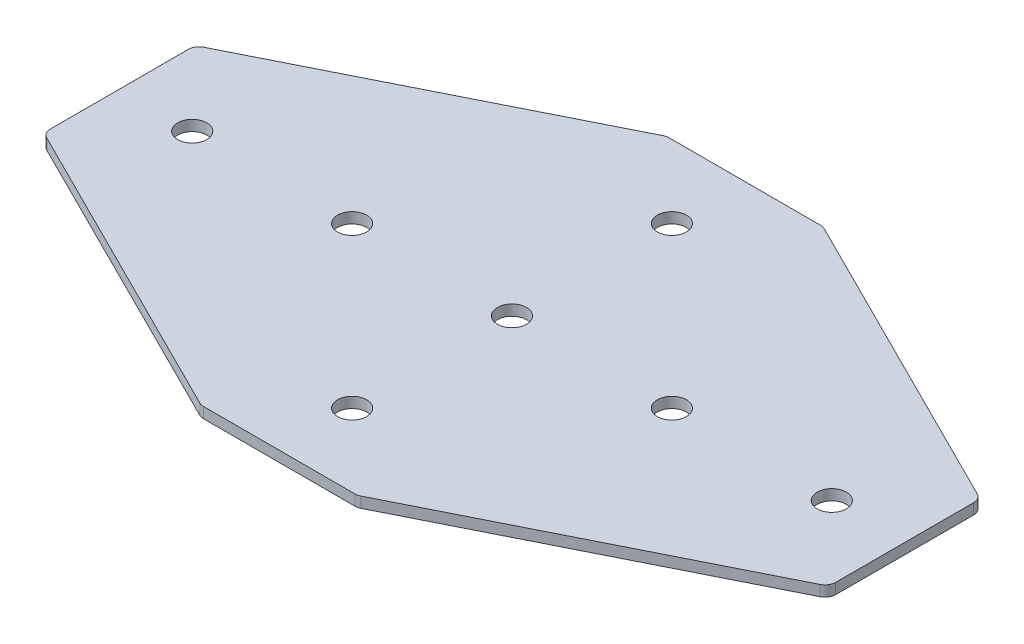
ISO-10303-21;
HEADER;
FILE_DESCRIPTION(('STEP AP214'),'2;1');
FILE_NAME('part.step','',(''),(''),'','','');
FILE_SCHEMA(('AUTOMOTIVE_DESIGN { 1 0 10303 214 1 1 1 1 }'));
ENDSEC;
DATA;
#1=APPLICATION_CONTEXT('core data for automotive mechanical design processes');
#2=APPLICATION_PROTOCOL_DEFINITION('international standard','automotive_design',2000,#1);
#3=PRODUCT_CONTEXT('',#1,'mechanical');
#4=PRODUCT('Part','Part','',(#3));
#5=PRODUCT_RELATED_PRODUCT_CATEGORY('part','',(#4));
#6=PRODUCT_DEFINITION_FORMATION('','',#4);
#7=PRODUCT_DEFINITION_CONTEXT('part definition',#1,'design');
#8=PRODUCT_DEFINITION('design','',#6,#7);
#9=PRODUCT_DEFINITION_SHAPE('','',#8);
#10=(LENGTH_UNIT() NAMED_UNIT(*) SI_UNIT(.MILLI.,.METRE.));
#11=(NAMED_UNIT(*) PLANE_ANGLE_UNIT() SI_UNIT($,.RADIAN.));
#12=(NAMED_UNIT(*) SI_UNIT($,.STERADIAN.) SOLID_ANGLE_UNIT());
#13=UNCERTAINTY_MEASURE_WITH_UNIT(LENGTH_MEASURE(1.E-05),#10,'distance_accuracy_value','');
#14=(GEOMETRIC_REPRESENTATION_CONTEXT(3) GLOBAL_UNCERTAINTY_ASSIGNED_CONTEXT((#13)) GLOBAL_UNIT_ASSIGNED_CONTEXT((#10,
#11,#12)) REPRESENTATION_CONTEXT('',''));
#15=CARTESIAN_POINT('',(0.,0.,0.));
#16=DIRECTION('',(0.,0.,1.));
#17=DIRECTION('',(1.,0.,0.));
#18=AXIS2_PLACEMENT_3D('',#15,#16,#17);
#19=CARTESIAN_POINT('',(-1.6121183435871,0.774709326741231,-0.662221309141842));
#20=DIRECTION('',(0.,-1.,0.));
#21=DIRECTION('',(0.,0.,-1.));
#22=AXIS2_PLACEMENT_3D('',#19,#20,#21);
#23=PLANE('',#22);
#24=CARTESIAN_POINT('',(-46.6121183435871,0.774709326741231,-0.66222130914182));
#25=DIRECTION('',(0.,-1.,0.));
#26=DIRECTION('',(0.,0.,1.));
#27=AXIS2_PLACEMENT_3D('',#24,#25,#26);
#28=CIRCLE('',#27,4.1);
#29=CARTESIAN_POINT('',(-46.6121183435871,0.774709326741231,3.43777869085818));
#30=VERTEX_POINT('',#29);
#31=EDGE_CURVE('E194',#30,#30,#28,.T.);
#32=ORIENTED_EDGE('',*,*,#31,.F.);
#33=EDGE_LOOP('',(#32));
#34=FACE_BOUND('',#33,.T.);
#35=CARTESIAN_POINT('',(-91.6121183435871,0.774709326741231,-0.66222130914182));
#36=DIRECTION('',(0.,-1.,0.));
#37=DIRECTION('',(0.,0.,1.));
#38=AXIS2_PLACEMENT_3D('',#35,#36,#37);
#39=CIRCLE('',#38,4.09999999999999);
#40=CARTESIAN_POINT('',(-91.6121183435871,0.774709326741231,3.43777869085817));
#41=VERTEX_POINT('',#40);
#42=EDGE_CURVE('E188',#41,#41,#39,.T.);
#43=ORIENTED_EDGE('',*,*,#42,.F.);
#44=EDGE_LOOP('',(#43));
#45=FACE_BOUND('',#44,.T.);
#46=CARTESIAN_POINT('',(-1.6121183435871,0.774709326741231,-0.662221309141842));
#47=DIRECTION('',(0.,1.,0.));
#48=DIRECTION('',(0.,0.,1.));
#49=AXIS2_PLACEMENT_3D('',#46,#47,#48);
#50=CIRCLE('',#49,4.1);
#51=CARTESIAN_POINT('',(-1.6121183435871,0.774709326741231,3.43777869085816));
#52=VERTEX_POINT('',#51);
#53=EDGE_CURVE('E248',#52,#52,#50,.T.);
#54=ORIENTED_EDGE('',*,*,#53,.T.);
#55=EDGE_LOOP('',(#54));
#56=FACE_BOUND('',#55,.T.);
#57=CARTESIAN_POINT('',(105.887881656413,0.774709326741231,-20.0720513653924));
#58=DIRECTION('',(0.,1.,0.));
#59=DIRECTION('',(0.,0.,1.));
#60=AXIS2_PLACEMENT_3D('',#57,#58,#59);
#61=CIRCLE('',#60,3.);
#62=CARTESIAN_POINT('',(108.887881656413,0.774709326741231,-20.0720513653924));
#63=VERTEX_POINT('',#62);
#64=CARTESIAN_POINT('',(107.229522442913,0.774709326741231,-22.7553329383922));
#65=VERTEX_POINT('',#64);
#66=EDGE_CURVE('E174',#63,#65,#61,.T.);
#67=ORIENTED_EDGE('',*,*,#66,.F.);
#68=DIRECTION('',(0.,0.,-1.));
#69=VECTOR('',#68,1.);
#70=CARTESIAN_POINT('',(108.887881656413,0.774709326741231,20.6017107133584));
#71=LINE('',#70,#69);
#72=CARTESIAN_POINT('',(108.887881656413,0.774709326741231,18.7476087471087));
#73=VERTEX_POINT('',#72);
#74=EDGE_CURVE('E259',#73,#63,#71,.T.);
#75=ORIENTED_EDGE('',*,*,#74,.F.);
#76=CARTESIAN_POINT('',(105.887881656413,0.774709326741231,18.7476087471087));
#77=DIRECTION('',(0.,-1.,0.));
#78=DIRECTION('',(0.,0.,-1.));
#79=AXIS2_PLACEMENT_3D('',#76,#77,#78);
#80=CIRCLE('',#79,3.);
#81=CARTESIAN_POINT('',(107.229522442913,0.774709326741231,21.4308903201085));
#82=VERTEX_POINT('',#81);
#83=EDGE_CURVE('E31',#73,#82,#80,.T.);
#84=ORIENTED_EDGE('',*,*,#83,.T.);
#85=DIRECTION('',(0.894427190999916,0.,-0.447213595499957));
#86=VECTOR('',#85,1.);
#87=CARTESIAN_POINT('',(20.4157457014133,0.774709326741231,64.8377786908581));
#88=LINE('',#87,#86);
#89=CARTESIAN_POINT('',(21.0491825554138,0.774709326741231,64.5210602638579));
#90=VERTEX_POINT('',#89);
#91=EDGE_CURVE('E256',#90,#82,#88,.T.);
#92=ORIENTED_EDGE('',*,*,#91,.F.);
#93=CARTESIAN_POINT('',(19.7075417689139,0.774709326741231,61.8377786908581));
#94=DIRECTION('',(0.,-1.,0.));
#95=DIRECTION('',(0.,0.,-1.));
#96=AXIS2_PLACEMENT_3D('',#93,#94,#95);
#97=CIRCLE('',#96,3.);
#98=CARTESIAN_POINT('',(19.707541768914,0.774709326741231,64.8377786908581));
#99=VERTEX_POINT('',#98);
#100=EDGE_CURVE('E274',#90,#99,#97,.T.);
#101=ORIENTED_EDGE('',*,*,#100,.T.);
#102=DIRECTION('',(1.,0.,0.));
#103=VECTOR('',#102,1.);
#104=CARTESIAN_POINT('',(-22.1121183435871,0.774709326741231,64.8377786908581));
#105=LINE('',#104,#103);
#106=CARTESIAN_POINT('',(-22.9317784560881,0.774709326741231,64.8377786908581));
#107=VERTEX_POINT('',#106);
#108=EDGE_CURVE('E254',#107,#99,#105,.T.);
#109=ORIENTED_EDGE('',*,*,#108,.F.);
#110=CARTESIAN_POINT('',(-22.9317784560881,0.774709326741231,61.8377786908581));
#111=DIRECTION('',(0.,1.,0.));
#112=DIRECTION('',(0.,0.,-1.));
#113=AXIS2_PLACEMENT_3D('',#110,#111,#112);
#114=CIRCLE('',#113,3.);
#115=CARTESIAN_POINT('',(-24.273419242588,0.774709326741231,64.5210602638579));
#116=VERTEX_POINT('',#115);
#117=EDGE_CURVE('E219',#116,#107,#114,.T.);
#118=ORIENTED_EDGE('',*,*,#117,.F.);
#119=DIRECTION('',(-0.894427190999916,0.,-0.447213595499957));
#120=VECTOR('',#119,1.);
#121=CARTESIAN_POINT('',(-23.6399823885875,0.774709326741231,64.8377786908581));
#122=LINE('',#121,#120);
#123=CARTESIAN_POINT('',(-110.453759130087,0.774709326741231,21.4308903201085));
#124=VERTEX_POINT('',#123);
#125=EDGE_CURVE('E200',#116,#124,#122,.T.);
#126=ORIENTED_EDGE('',*,*,#125,.T.);
#127=CARTESIAN_POINT('',(-109.112118343587,0.774709326741231,18.7476087471087));
#128=DIRECTION('',(0.,1.,0.));
#129=DIRECTION('',(0.,0.,-1.));
#130=AXIS2_PLACEMENT_3D('',#127,#128,#129);
#131=CIRCLE('',#130,3.);
#132=CARTESIAN_POINT('',(-112.112118343587,0.774709326741231,18.7476087471087));
#133=VERTEX_POINT('',#132);
#134=EDGE_CURVE('E216',#133,#124,#131,.T.);
#135=ORIENTED_EDGE('',*,*,#134,.F.);
#136=DIRECTION('',(0.,0.,-1.));
#137=VECTOR('',#136,1.);
#138=CARTESIAN_POINT('',(-112.112118343587,0.774709326741231,20.6017107133584));
#139=LINE('',#138,#137);
#140=CARTESIAN_POINT('',(-112.112118343587,0.774709326741231,-20.0720513653924));
#141=VERTEX_POINT('',#140);
#142=EDGE_CURVE('E203',#133,#141,#139,.T.);
#143=ORIENTED_EDGE('',*,*,#142,.T.);
#144=CARTESIAN_POINT('',(-109.112118343587,0.774709326741231,-20.0720513653924));
#145=DIRECTION('',(0.,-1.,0.));
#146=DIRECTION('',(0.,0.,1.));
#147=AXIS2_PLACEMENT_3D('',#144,#145,#146);
#148=CIRCLE('',#147,3.);
#149=CARTESIAN_POINT('',(-110.453759130087,0.774709326741231,-22.7553329383922));
#150=VERTEX_POINT('',#149);
#151=EDGE_CURVE('E140',#141,#150,#148,.T.);
#152=ORIENTED_EDGE('',*,*,#151,.T.);
#153=DIRECTION('',(-0.894427190999916,0.,0.447213595499957));
#154=VECTOR('',#153,1.);
#155=CARTESIAN_POINT('',(-23.6399823885875,0.774709326741231,-66.1622213091418));
#156=LINE('',#155,#154);
#157=CARTESIAN_POINT('',(-24.273419242588,0.774709326741231,-65.8455028821415));
#158=VERTEX_POINT('',#157);
#159=EDGE_CURVE('E414',#158,#150,#156,.T.);
#160=ORIENTED_EDGE('',*,*,#159,.F.);
#161=CARTESIAN_POINT('',(-22.9317784560881,0.774709326741231,-63.1622213091418));
#162=DIRECTION('',(0.,-1.,0.));
#163=DIRECTION('',(0.,0.,1.));
#164=AXIS2_PLACEMENT_3D('',#161,#162,#163);
#165=CIRCLE('',#164,3.);
#166=CARTESIAN_POINT('',(-22.9317784560881,0.774709326741231,-66.1622213091418));
#167=VERTEX_POINT('',#166);
#168=EDGE_CURVE('E399',#158,#167,#165,.T.);
#169=ORIENTED_EDGE('',*,*,#168,.T.);
#170=DIRECTION('',(1.,0.,0.));
#171=VECTOR('',#170,1.);
#172=CARTESIAN_POINT('',(-22.1121183435871,0.774709326741231,-66.1622213091418));
#173=LINE('',#172,#171);
#174=CARTESIAN_POINT('',(19.707541768914,0.774709326741231,-66.1622213091418));
#175=VERTEX_POINT('',#174);
#176=EDGE_CURVE('E136',#167,#175,#173,.T.);
#177=ORIENTED_EDGE('',*,*,#176,.T.);
#178=CARTESIAN_POINT('',(19.7075417689139,0.774709326741231,-63.1622213091418));
#179=DIRECTION('',(0.,1.,0.));
#180=DIRECTION('',(0.,0.,1.));
#181=AXIS2_PLACEMENT_3D('',#178,#179,#180);
#182=CIRCLE('',#181,3.);
#183=CARTESIAN_POINT('',(21.0491825554138,0.774709326741231,-65.8455028821415));
#184=VERTEX_POINT('',#183);
#185=EDGE_CURVE('E177',#184,#175,#182,.T.);
#186=ORIENTED_EDGE('',*,*,#185,.F.);
#187=DIRECTION('',(0.894427190999916,0.,0.447213595499957));
#188=VECTOR('',#187,1.);
#189=CARTESIAN_POINT('',(20.4157457014133,0.774709326741231,-66.1622213091418));
#190=LINE('',#189,#188);
#191=EDGE_CURVE('E165',#184,#65,#190,.T.);
#192=ORIENTED_EDGE('',*,*,#191,.T.);
#193=EDGE_LOOP('',(#67,#75,#84,#92,#101,#109,#118,#126,#135,#143,#152,#160,#169,#177,#186,#192));
#194=FACE_BOUND('',#193,.T.);
#195=CARTESIAN_POINT('',(88.3878816564129,0.774709326741231,-0.662221309141842));
#196=DIRECTION('',(0.,1.,0.));
#197=DIRECTION('',(0.,0.,1.));
#198=AXIS2_PLACEMENT_3D('',#195,#196,#197);
#199=CIRCLE('',#198,4.09999999999999);
#200=CARTESIAN_POINT('',(88.3878816564129,0.774709326741231,3.43777869085814));
#201=VERTEX_POINT('',#200);
#202=EDGE_CURVE('E230',#201,#201,#199,.T.);
#203=ORIENTED_EDGE('',*,*,#202,.T.);
#204=EDGE_LOOP('',(#203));
#205=FACE_BOUND('',#204,.T.);
#206=CARTESIAN_POINT('',(-1.61211834358711,0.774709326741231,44.3377786908582));
#207=DIRECTION('',(0.,1.,0.));
#208=DIRECTION('',(0.,0.,1.));
#209=AXIS2_PLACEMENT_3D('',#206,#207,#208);
#210=CIRCLE('',#209,4.1);
#211=CARTESIAN_POINT('',(-1.61211834358711,0.774709326741231,48.4377786908582));
#212=VERTEX_POINT('',#211);
#213=EDGE_CURVE('E236',#212,#212,#210,.T.);
#214=ORIENTED_EDGE('',*,*,#213,.T.);
#215=EDGE_LOOP('',(#214));
#216=FACE_BOUND('',#215,.T.);
#217=CARTESIAN_POINT('',(43.3878816564129,0.774709326741231,-0.662221309141831));
#218=DIRECTION('',(0.,1.,0.));
#219=DIRECTION('',(0.,0.,1.));
#220=AXIS2_PLACEMENT_3D('',#217,#218,#219);
#221=CIRCLE('',#220,4.1);
#222=CARTESIAN_POINT('',(43.3878816564129,0.774709326741231,3.43777869085817));
#223=VERTEX_POINT('',#222);
#224=EDGE_CURVE('E242',#223,#223,#221,.T.);
#225=ORIENTED_EDGE('',*,*,#224,.T.);
#226=EDGE_LOOP('',(#225));
#227=FACE_BOUND('',#226,.T.);
#228=CARTESIAN_POINT('',(-1.61211834358711,0.774709326741231,-45.6622213091418));
#229=DIRECTION('',(0.,-1.,0.));
#230=DIRECTION('',(0.,0.,-1.));
#231=AXIS2_PLACEMENT_3D('',#228,#229,#230);
#232=CIRCLE('',#231,4.1);
#233=CARTESIAN_POINT('',(-1.61211834358711,0.774709326741231,-49.7622213091418));
#234=VERTEX_POINT('',#233);
#235=EDGE_CURVE('E157',#234,#234,#232,.T.);
#236=ORIENTED_EDGE('',*,*,#235,.F.);
#237=EDGE_LOOP('',(#236));
#238=FACE_BOUND('',#237,.T.);
#239=ADVANCED_FACE('F16',(#34,#45,#56,#194,#205,#216,#227,#238),#23,.T.);
#240=CARTESIAN_POINT('',(108.887881656413,0.774709326741231,20.6017107133584));
#241=DIRECTION('',(1.,0.,0.));
#242=DIRECTION('',(0.,0.,-1.));
#243=AXIS2_PLACEMENT_3D('',#240,#241,#242);
#244=PLANE('',#243);
#245=ORIENTED_EDGE('',*,*,#74,.T.);
#246=DIRECTION('',(0.,1.,0.));
#247=VECTOR('',#246,1.);
#248=CARTESIAN_POINT('',(108.887881656413,0.774709326741231,-20.0720513653924));
#249=LINE('',#248,#247);
#250=CARTESIAN_POINT('',(108.887881656413,3.77470932674123,-20.0720513653924));
#251=VERTEX_POINT('',#250);
#252=EDGE_CURVE('E184',#251,#63,#249,.F.);
#253=ORIENTED_EDGE('',*,*,#252,.F.);
#254=DIRECTION('',(0.,0.,-1.));
#255=VECTOR('',#254,1.);
#256=CARTESIAN_POINT('',(108.887881656413,3.77470932674123,20.6017107133584));
#257=LINE('',#256,#255);
#258=CARTESIAN_POINT('',(108.887881656413,3.77470932674123,18.7476087471087));
#259=VERTEX_POINT('',#258);
#260=EDGE_CURVE('E257',#259,#251,#257,.T.);
#261=ORIENTED_EDGE('',*,*,#260,.F.);
#262=DIRECTION('',(0.,1.,0.));
#263=VECTOR('',#262,1.);
#264=CARTESIAN_POINT('',(108.887881656413,0.774709326741231,18.7476087471087));
#265=LINE('',#264,#263);
#266=EDGE_CURVE('E10',#259,#73,#265,.F.);
#267=ORIENTED_EDGE('',*,*,#266,.T.);
#268=EDGE_LOOP('',(#245,#253,#261,#267));
#269=FACE_BOUND('',#268,.T.);
#270=ADVANCED_FACE('F297',(#269),#244,.T.);
#271=CARTESIAN_POINT('',(-1.6121183435871,3.77470932674123,-0.662221309141842));
#272=DIRECTION('',(0.,-1.,0.));
#273=DIRECTION('',(0.,0.,-1.));
#274=AXIS2_PLACEMENT_3D('',#271,#272,#273);
#275=PLANE('',#274);
#276=CARTESIAN_POINT('',(-46.6121183435871,3.77470932674123,-0.66222130914182));
#277=DIRECTION('',(0.,-1.,0.));
#278=DIRECTION('',(0.,0.,1.));
#279=AXIS2_PLACEMENT_3D('',#276,#277,#278);
#280=CIRCLE('',#279,4.1);
#281=CARTESIAN_POINT('',(-46.6121183435871,3.77470932674123,3.43777869085818));
#282=VERTEX_POINT('',#281);
#283=EDGE_CURVE('E191',#282,#282,#280,.T.);
#284=ORIENTED_EDGE('',*,*,#283,.T.);
#285=EDGE_LOOP('',(#284));
#286=FACE_BOUND('',#285,.T.);
#287=CARTESIAN_POINT('',(-91.6121183435871,3.77470932674123,-0.66222130914182));
#288=DIRECTION('',(0.,-1.,0.));
#289=DIRECTION('',(0.,0.,1.));
#290=AXIS2_PLACEMENT_3D('',#287,#288,#289);
#291=CIRCLE('',#290,4.09999999999999);
#292=CARTESIAN_POINT('',(-91.6121183435871,3.77470932674123,3.43777869085817));
#293=VERTEX_POINT('',#292);
#294=EDGE_CURVE('E187',#293,#293,#291,.T.);
#295=ORIENTED_EDGE('',*,*,#294,.T.);
#296=EDGE_LOOP('',(#295));
#297=FACE_BOUND('',#296,.T.);
#298=CARTESIAN_POINT('',(-1.6121183435871,3.77470932674123,-0.662221309141842));
#299=DIRECTION('',(0.,1.,0.));
#300=DIRECTION('',(0.,0.,1.));
#301=AXIS2_PLACEMENT_3D('',#298,#299,#300);
#302=CIRCLE('',#301,4.1);
#303=CARTESIAN_POINT('',(-1.6121183435871,3.77470932674123,3.43777869085816));
#304=VERTEX_POINT('',#303);
#305=EDGE_CURVE('E245',#304,#304,#302,.T.);
#306=ORIENTED_EDGE('',*,*,#305,.F.);
#307=EDGE_LOOP('',(#306));
#308=FACE_BOUND('',#307,.T.);
#309=ORIENTED_EDGE('',*,*,#260,.T.);
#310=CARTESIAN_POINT('',(105.887881656413,3.77470932674123,-20.0720513653924));
#311=DIRECTION('',(0.,1.,0.));
#312=DIRECTION('',(0.,0.,1.));
#313=AXIS2_PLACEMENT_3D('',#310,#311,#312);
#314=CIRCLE('',#313,3.);
#315=CARTESIAN_POINT('',(107.229522442913,3.77470932674123,-22.7553329383922));
#316=VERTEX_POINT('',#315);
#317=EDGE_CURVE('E168',#316,#251,#314,.F.);
#318=ORIENTED_EDGE('',*,*,#317,.F.);
#319=DIRECTION('',(0.894427190999916,0.,0.447213595499957));
#320=VECTOR('',#319,1.);
#321=CARTESIAN_POINT('',(20.4157457014133,3.77470932674123,-66.1622213091418));
#322=LINE('',#321,#320);
#323=CARTESIAN_POINT('',(21.0491825554138,3.77470932674123,-65.8455028821415));
#324=VERTEX_POINT('',#323);
#325=EDGE_CURVE('E156',#324,#316,#322,.T.);
#326=ORIENTED_EDGE('',*,*,#325,.F.);
#327=CARTESIAN_POINT('',(19.7075417689139,3.77470932674123,-63.1622213091418));
#328=DIRECTION('',(0.,1.,0.));
#329=DIRECTION('',(0.,0.,1.));
#330=AXIS2_PLACEMENT_3D('',#327,#328,#329);
#331=CIRCLE('',#330,3.);
#332=CARTESIAN_POINT('',(19.707541768914,3.77470932674123,-66.1622213091418));
#333=VERTEX_POINT('',#332);
#334=EDGE_CURVE('E155',#333,#324,#331,.F.);
#335=ORIENTED_EDGE('',*,*,#334,.F.);
#336=DIRECTION('',(1.,0.,0.));
#337=VECTOR('',#336,1.);
#338=CARTESIAN_POINT('',(-22.1121183435871,3.77470932674123,-66.1622213091418));
#339=LINE('',#338,#337);
#340=CARTESIAN_POINT('',(-22.9317784560881,3.77470932674123,-66.1622213091418));
#341=VERTEX_POINT('',#340);
#342=EDGE_CURVE('E133',#341,#333,#339,.T.);
#343=ORIENTED_EDGE('',*,*,#342,.F.);
#344=CARTESIAN_POINT('',(-22.9317784560881,3.77470932674123,-63.1622213091418));
#345=DIRECTION('',(0.,-1.,0.));
#346=DIRECTION('',(0.,0.,1.));
#347=AXIS2_PLACEMENT_3D('',#344,#345,#346);
#348=CIRCLE('',#347,3.);
#349=CARTESIAN_POINT('',(-24.273419242588,3.77470932674123,-65.8455028821415));
#350=VERTEX_POINT('',#349);
#351=EDGE_CURVE('E141',#341,#350,#348,.F.);
#352=ORIENTED_EDGE('',*,*,#351,.T.);
#353=DIRECTION('',(-0.894427190999916,0.,0.447213595499957));
#354=VECTOR('',#353,1.);
#355=CARTESIAN_POINT('',(-23.6399823885875,3.77470932674123,-66.1622213091418));
#356=LINE('',#355,#354);
#357=CARTESIAN_POINT('',(-110.453759130087,3.77470932674123,-22.7553329383922));
#358=VERTEX_POINT('',#357);
#359=EDGE_CURVE('E415',#350,#358,#356,.T.);
#360=ORIENTED_EDGE('',*,*,#359,.T.);
#361=CARTESIAN_POINT('',(-109.112118343587,3.77470932674123,-20.0720513653924));
#362=DIRECTION('',(0.,-1.,0.));
#363=DIRECTION('',(0.,0.,1.));
#364=AXIS2_PLACEMENT_3D('',#361,#362,#363);
#365=CIRCLE('',#364,3.);
#366=CARTESIAN_POINT('',(-112.112118343587,3.77470932674123,-20.0720513653924));
#367=VERTEX_POINT('',#366);
#368=EDGE_CURVE('E149',#358,#367,#365,.F.);
#369=ORIENTED_EDGE('',*,*,#368,.T.);
#370=DIRECTION('',(0.,0.,-1.));
#371=VECTOR('',#370,1.);
#372=CARTESIAN_POINT('',(-112.112118343587,3.77470932674123,20.6017107133584));
#373=LINE('',#372,#371);
#374=CARTESIAN_POINT('',(-112.112118343587,3.77470932674123,18.7476087471087));
#375=VERTEX_POINT('',#374);
#376=EDGE_CURVE('E204',#375,#367,#373,.T.);
#377=ORIENTED_EDGE('',*,*,#376,.F.);
#378=CARTESIAN_POINT('',(-109.112118343587,3.77470932674123,18.7476087471087));
#379=DIRECTION('',(0.,1.,0.));
#380=DIRECTION('',(0.,0.,-1.));
#381=AXIS2_PLACEMENT_3D('',#378,#379,#380);
#382=CIRCLE('',#381,3.);
#383=CARTESIAN_POINT('',(-110.453759130087,3.77470932674123,21.4308903201085));
#384=VERTEX_POINT('',#383);
#385=EDGE_CURVE('E206',#384,#375,#382,.F.);
#386=ORIENTED_EDGE('',*,*,#385,.F.);
#387=DIRECTION('',(-0.894427190999916,0.,-0.447213595499957));
#388=VECTOR('',#387,1.);
#389=CARTESIAN_POINT('',(-23.6399823885875,3.77470932674123,64.8377786908581));
#390=LINE('',#389,#388);
#391=CARTESIAN_POINT('',(-24.273419242588,3.77470932674123,64.5210602638579));
#392=VERTEX_POINT('',#391);
#393=EDGE_CURVE('E197',#392,#384,#390,.T.);
#394=ORIENTED_EDGE('',*,*,#393,.F.);
#395=CARTESIAN_POINT('',(-22.9317784560881,3.77470932674123,61.8377786908581));
#396=DIRECTION('',(0.,1.,0.));
#397=DIRECTION('',(0.,0.,-1.));
#398=AXIS2_PLACEMENT_3D('',#395,#396,#397);
#399=CIRCLE('',#398,3.);
#400=CARTESIAN_POINT('',(-22.9317784560881,3.77470932674123,64.8377786908581));
#401=VERTEX_POINT('',#400);
#402=EDGE_CURVE('E211',#401,#392,#399,.F.);
#403=ORIENTED_EDGE('',*,*,#402,.F.);
#404=DIRECTION('',(1.,0.,0.));
#405=VECTOR('',#404,1.);
#406=CARTESIAN_POINT('',(-22.1121183435871,3.77470932674123,64.8377786908581));
#407=LINE('',#406,#405);
#408=CARTESIAN_POINT('',(19.707541768914,3.77470932674123,64.8377786908581));
#409=VERTEX_POINT('',#408);
#410=EDGE_CURVE('E251',#401,#409,#407,.T.);
#411=ORIENTED_EDGE('',*,*,#410,.T.);
#412=CARTESIAN_POINT('',(19.7075417689139,3.77470932674123,61.8377786908581));
#413=DIRECTION('',(0.,-1.,0.));
#414=DIRECTION('',(0.,0.,-1.));
#415=AXIS2_PLACEMENT_3D('',#412,#413,#414);
#416=CIRCLE('',#415,3.);
#417=CARTESIAN_POINT('',(21.0491825554138,3.77470932674123,64.5210602638579));
#418=VERTEX_POINT('',#417);
#419=EDGE_CURVE('E268',#409,#418,#416,.F.);
#420=ORIENTED_EDGE('',*,*,#419,.T.);
#421=DIRECTION('',(0.894427190999916,0.,-0.447213595499957));
#422=VECTOR('',#421,1.);
#423=CARTESIAN_POINT('',(20.4157457014133,3.77470932674123,64.8377786908581));
#424=LINE('',#423,#422);
#425=CARTESIAN_POINT('',(107.229522442913,3.77470932674123,21.4308903201085));
#426=VERTEX_POINT('',#425);
#427=EDGE_CURVE('E263',#418,#426,#424,.T.);
#428=ORIENTED_EDGE('',*,*,#427,.T.);
#429=CARTESIAN_POINT('',(105.887881656413,3.77470932674123,18.7476087471087));
#430=DIRECTION('',(0.,-1.,0.));
#431=DIRECTION('',(0.,0.,-1.));
#432=AXIS2_PLACEMENT_3D('',#429,#430,#431);
#433=CIRCLE('',#432,3.);
#434=EDGE_CURVE('E261',#426,#259,#433,.F.);
#435=ORIENTED_EDGE('',*,*,#434,.T.);
#436=EDGE_LOOP('',(#309,#318,#326,#335,#343,#352,#360,#369,#377,#386,#394,#403,#411,#420,#428,#435));
#437=FACE_BOUND('',#436,.T.);
#438=CARTESIAN_POINT('',(88.3878816564129,3.77470932674123,-0.662221309141842));
#439=DIRECTION('',(0.,1.,0.));
#440=DIRECTION('',(0.,0.,1.));
#441=AXIS2_PLACEMENT_3D('',#438,#439,#440);
#442=CIRCLE('',#441,4.09999999999999);
#443=CARTESIAN_POINT('',(88.3878816564129,3.77470932674123,3.43777869085814));
#444=VERTEX_POINT('',#443);
#445=EDGE_CURVE('E229',#444,#444,#442,.T.);
#446=ORIENTED_EDGE('',*,*,#445,.F.);
#447=EDGE_LOOP('',(#446));
#448=FACE_BOUND('',#447,.T.);
#449=CARTESIAN_POINT('',(-1.61211834358711,3.77470932674123,44.3377786908582));
#450=DIRECTION('',(0.,1.,0.));
#451=DIRECTION('',(0.,0.,1.));
#452=AXIS2_PLACEMENT_3D('',#449,#450,#451);
#453=CIRCLE('',#452,4.1);
#454=CARTESIAN_POINT('',(-1.61211834358711,3.77470932674123,48.4377786908582));
#455=VERTEX_POINT('',#454);
#456=EDGE_CURVE('E233',#455,#455,#453,.T.);
#457=ORIENTED_EDGE('',*,*,#456,.F.);
#458=EDGE_LOOP('',(#457));
#459=FACE_BOUND('',#458,.T.);
#460=CARTESIAN_POINT('',(43.3878816564129,3.77470932674123,-0.662221309141831));
#461=DIRECTION('',(0.,1.,0.));
#462=DIRECTION('',(0.,0.,1.));
#463=AXIS2_PLACEMENT_3D('',#460,#461,#462);
#464=CIRCLE('',#463,4.1);
#465=CARTESIAN_POINT('',(43.3878816564129,3.77470932674123,3.43777869085817));
#466=VERTEX_POINT('',#465);
#467=EDGE_CURVE('E239',#466,#466,#464,.T.);
#468=ORIENTED_EDGE('',*,*,#467,.F.);
#469=EDGE_LOOP('',(#468));
#470=FACE_BOUND('',#469,.T.);
#471=CARTESIAN_POINT('',(-1.61211834358711,3.77470932674123,-45.6622213091418));
#472=DIRECTION('',(0.,-1.,0.));
#473=DIRECTION('',(0.,0.,-1.));
#474=AXIS2_PLACEMENT_3D('',#471,#472,#473);
#475=CIRCLE('',#474,4.1);
#476=CARTESIAN_POINT('',(-1.61211834358711,3.77470932674123,-49.7622213091418));
#477=VERTEX_POINT('',#476);
#478=EDGE_CURVE('E162',#477,#477,#475,.T.);
#479=ORIENTED_EDGE('',*,*,#478,.T.);
#480=EDGE_LOOP('',(#479));
#481=FACE_BOUND('',#480,.T.);
#482=ADVANCED_FACE('F151',(#286,#297,#308,#437,#448,#459,#470,#481),#275,.F.);
#483=CARTESIAN_POINT('',(-1.6121183435871,0.774709326741231,-0.662221309141842));
#484=DIRECTION('',(0.,1.,0.));
#485=DIRECTION('',(0.,0.,1.));
#486=AXIS2_PLACEMENT_3D('',#483,#484,#485);
#487=CYLINDRICAL_SURFACE('',#486,4.1);
#488=ORIENTED_EDGE('',*,*,#53,.F.);
#489=EDGE_LOOP('',(#488));
#490=FACE_BOUND('',#489,.T.);
#491=ORIENTED_EDGE('',*,*,#305,.T.);
#492=EDGE_LOOP('',(#491));
#493=FACE_BOUND('',#492,.T.);
#494=ADVANCED_FACE('F373',(#490,#493),#487,.F.);
#495=CARTESIAN_POINT('',(43.3878816564129,0.774709326741231,-0.662221309141831));
#496=DIRECTION('',(0.,1.,0.));
#497=DIRECTION('',(0.,0.,1.));
#498=AXIS2_PLACEMENT_3D('',#495,#496,#497);
#499=CYLINDRICAL_SURFACE('',#498,4.1);
#500=ORIENTED_EDGE('',*,*,#467,.T.);
#501=EDGE_LOOP('',(#500));
#502=FACE_BOUND('',#501,.T.);
#503=ORIENTED_EDGE('',*,*,#224,.F.);
#504=EDGE_LOOP('',(#503));
#505=FACE_BOUND('',#504,.T.);
#506=ADVANCED_FACE('F366',(#502,#505),#499,.F.);
#507=CARTESIAN_POINT('',(88.3878816564129,0.774709326741231,-0.662221309141842));
#508=DIRECTION('',(0.,1.,0.));
#509=DIRECTION('',(0.,0.,1.));
#510=AXIS2_PLACEMENT_3D('',#507,#508,#509);
#511=CYLINDRICAL_SURFACE('',#510,4.09999999999999);
#512=ORIENTED_EDGE('',*,*,#445,.T.);
#513=EDGE_LOOP('',(#512));
#514=FACE_BOUND('',#513,.T.);
#515=ORIENTED_EDGE('',*,*,#202,.F.);
#516=EDGE_LOOP('',(#515));
#517=FACE_BOUND('',#516,.T.);
#518=ADVANCED_FACE('F350',(#514,#517),#511,.F.);
#519=CARTESIAN_POINT('',(-112.112118343587,0.774709326741231,20.6017107133584));
#520=DIRECTION('',(-1.,0.,0.));
#521=DIRECTION('',(0.,0.,-1.));
#522=AXIS2_PLACEMENT_3D('',#519,#520,#521);
#523=PLANE('',#522);
#524=ORIENTED_EDGE('',*,*,#376,.T.);
#525=DIRECTION('',(0.,1.,0.));
#526=VECTOR('',#525,1.);
#527=CARTESIAN_POINT('',(-112.112118343587,0.774709326741231,-20.0720513653924));
#528=LINE('',#527,#526);
#529=EDGE_CURVE('E402',#367,#141,#528,.F.);
#530=ORIENTED_EDGE('',*,*,#529,.T.);
#531=ORIENTED_EDGE('',*,*,#142,.F.);
#532=DIRECTION('',(0.,1.,0.));
#533=VECTOR('',#532,1.);
#534=CARTESIAN_POINT('',(-112.112118343587,0.774709326741231,18.7476087471087));
#535=LINE('',#534,#533);
#536=EDGE_CURVE('E227',#375,#133,#535,.F.);
#537=ORIENTED_EDGE('',*,*,#536,.F.);
#538=EDGE_LOOP('',(#524,#530,#531,#537));
#539=FACE_BOUND('',#538,.T.);
#540=ADVANCED_FACE('F346',(#539),#523,.T.);
#541=CARTESIAN_POINT('',(-46.6121183435871,0.774709326741231,-0.66222130914182));
#542=DIRECTION('',(0.,1.,0.));
#543=DIRECTION('',(0.,0.,1.));
#544=AXIS2_PLACEMENT_3D('',#541,#542,#543);
#545=CYLINDRICAL_SURFACE('',#544,4.1);
#546=ORIENTED_EDGE('',*,*,#31,.T.);
#547=EDGE_LOOP('',(#546));
#548=FACE_BOUND('',#547,.T.);
#549=ORIENTED_EDGE('',*,*,#283,.F.);
#550=EDGE_LOOP('',(#549));
#551=FACE_BOUND('',#550,.T.);
#552=ADVANCED_FACE('F342',(#548,#551),#545,.F.);
#553=CARTESIAN_POINT('',(-91.6121183435871,0.774709326741231,-0.66222130914182));
#554=DIRECTION('',(0.,1.,0.));
#555=DIRECTION('',(0.,0.,1.));
#556=AXIS2_PLACEMENT_3D('',#553,#554,#555);
#557=CYLINDRICAL_SURFACE('',#556,4.09999999999999);
#558=ORIENTED_EDGE('',*,*,#294,.F.);
#559=EDGE_LOOP('',(#558));
#560=FACE_BOUND('',#559,.T.);
#561=ORIENTED_EDGE('',*,*,#42,.T.);
#562=EDGE_LOOP('',(#561));
#563=FACE_BOUND('',#562,.T.);
#564=ADVANCED_FACE('F339',(#560,#563),#557,.F.);
#565=CARTESIAN_POINT('',(20.4157457014133,0.774709326741231,64.8377786908581));
#566=DIRECTION('',(0.447213595499957,0.,0.894427190999916));
#567=DIRECTION('',(0.894427190999916,0.,-0.447213595499957));
#568=AXIS2_PLACEMENT_3D('',#565,#566,#567);
#569=PLANE('',#568);
#570=ORIENTED_EDGE('',*,*,#427,.F.);
#571=DIRECTION('',(0.,1.,0.));
#572=VECTOR('',#571,1.);
#573=CARTESIAN_POINT('',(21.0491825554138,0.774709326741231,64.5210602638579));
#574=LINE('',#573,#572);
#575=EDGE_CURVE('E24',#418,#90,#574,.F.);
#576=ORIENTED_EDGE('',*,*,#575,.T.);
#577=ORIENTED_EDGE('',*,*,#91,.T.);
#578=DIRECTION('',(0.,1.,0.));
#579=VECTOR('',#578,1.);
#580=CARTESIAN_POINT('',(107.229522442913,0.774709326741231,21.4308903201085));
#581=LINE('',#580,#579);
#582=EDGE_CURVE('E277',#82,#426,#581,.T.);
#583=ORIENTED_EDGE('',*,*,#582,.T.);
#584=EDGE_LOOP('',(#570,#576,#577,#583));
#585=FACE_BOUND('',#584,.T.);
#586=ADVANCED_FACE('F280',(#585),#569,.T.);
#587=CARTESIAN_POINT('',(-22.1121183435871,0.774709326741231,64.8377786908581));
#588=DIRECTION('',(0.,0.,1.));
#589=DIRECTION('',(1.,0.,0.));
#590=AXIS2_PLACEMENT_3D('',#587,#588,#589);
#591=PLANE('',#590);
#592=ORIENTED_EDGE('',*,*,#410,.F.);
#593=DIRECTION('',(0.,1.,0.));
#594=VECTOR('',#593,1.);
#595=CARTESIAN_POINT('',(-22.9317784560881,0.774709326741231,64.8377786908581));
#596=LINE('',#595,#594);
#597=EDGE_CURVE('E213',#107,#401,#596,.T.);
#598=ORIENTED_EDGE('',*,*,#597,.F.);
#599=ORIENTED_EDGE('',*,*,#108,.T.);
#600=DIRECTION('',(0.,1.,0.));
#601=VECTOR('',#600,1.);
#602=CARTESIAN_POINT('',(19.707541768914,0.774709326741231,64.8377786908581));
#603=LINE('',#602,#601);
#604=EDGE_CURVE('E270',#99,#409,#603,.T.);
#605=ORIENTED_EDGE('',*,*,#604,.T.);
#606=EDGE_LOOP('',(#592,#598,#599,#605));
#607=FACE_BOUND('',#606,.T.);
#608=ADVANCED_FACE('F290',(#607),#591,.T.);
#609=CARTESIAN_POINT('',(19.7075417689139,0.774709326741231,61.8377786908581));
#610=DIRECTION('',(0.,1.,0.));
#611=DIRECTION('',(0.,0.,1.));
#612=AXIS2_PLACEMENT_3D('',#609,#610,#611);
#613=CYLINDRICAL_SURFACE('',#612,3.);
#614=ORIENTED_EDGE('',*,*,#100,.F.);
#615=ORIENTED_EDGE('',*,*,#575,.F.);
#616=ORIENTED_EDGE('',*,*,#419,.F.);
#617=ORIENTED_EDGE('',*,*,#604,.F.);
#618=EDGE_LOOP('',(#614,#615,#616,#617));
#619=FACE_BOUND('',#618,.T.);
#620=ADVANCED_FACE('F288',(#619),#613,.T.);
#621=CARTESIAN_POINT('',(105.887881656413,0.774709326741231,18.7476087471087));
#622=DIRECTION('',(0.,1.,0.));
#623=DIRECTION('',(0.,0.,1.));
#624=AXIS2_PLACEMENT_3D('',#621,#622,#623);
#625=CYLINDRICAL_SURFACE('',#624,3.);
#626=ORIENTED_EDGE('',*,*,#83,.F.);
#627=ORIENTED_EDGE('',*,*,#266,.F.);
#628=ORIENTED_EDGE('',*,*,#434,.F.);
#629=ORIENTED_EDGE('',*,*,#582,.F.);
#630=EDGE_LOOP('',(#626,#627,#628,#629));
#631=FACE_BOUND('',#630,.T.);
#632=ADVANCED_FACE('F18',(#631),#625,.T.);
#633=CARTESIAN_POINT('',(-1.61211834358711,0.774709326741231,44.3377786908582));
#634=DIRECTION('',(0.,1.,0.));
#635=DIRECTION('',(0.,0.,1.));
#636=AXIS2_PLACEMENT_3D('',#633,#634,#635);
#637=CYLINDRICAL_SURFACE('',#636,4.1);
#638=ORIENTED_EDGE('',*,*,#456,.T.);
#639=EDGE_LOOP('',(#638));
#640=FACE_BOUND('',#639,.T.);
#641=ORIENTED_EDGE('',*,*,#213,.F.);
#642=EDGE_LOOP('',(#641));
#643=FACE_BOUND('',#642,.T.);
#644=ADVANCED_FACE('F356',(#640,#643),#637,.F.);
#645=CARTESIAN_POINT('',(-23.6399823885875,0.774709326741231,64.8377786908581));
#646=DIRECTION('',(-0.447213595499957,0.,0.894427190999916));
#647=DIRECTION('',(-0.894427190999917,0.,-0.447213595499957));
#648=AXIS2_PLACEMENT_3D('',#645,#646,#647);
#649=PLANE('',#648);
#650=ORIENTED_EDGE('',*,*,#393,.T.);
#651=DIRECTION('',(0.,1.,0.));
#652=VECTOR('',#651,1.);
#653=CARTESIAN_POINT('',(-110.453759130087,0.774709326741231,21.4308903201085));
#654=LINE('',#653,#652);
#655=EDGE_CURVE('E222',#124,#384,#654,.T.);
#656=ORIENTED_EDGE('',*,*,#655,.F.);
#657=ORIENTED_EDGE('',*,*,#125,.F.);
#658=DIRECTION('',(0.,1.,0.));
#659=VECTOR('',#658,1.);
#660=CARTESIAN_POINT('',(-24.273419242588,0.774709326741231,64.5210602638579));
#661=LINE('',#660,#659);
#662=EDGE_CURVE('E225',#392,#116,#661,.F.);
#663=ORIENTED_EDGE('',*,*,#662,.F.);
#664=EDGE_LOOP('',(#650,#656,#657,#663));
#665=FACE_BOUND('',#664,.T.);
#666=ADVANCED_FACE('F352',(#665),#649,.T.);
#667=CARTESIAN_POINT('',(-22.9317784560881,0.774709326741231,61.8377786908581));
#668=DIRECTION('',(0.,1.,0.));
#669=DIRECTION('',(0.,0.,1.));
#670=AXIS2_PLACEMENT_3D('',#667,#668,#669);
#671=CYLINDRICAL_SURFACE('',#670,3.);
#672=ORIENTED_EDGE('',*,*,#117,.T.);
#673=ORIENTED_EDGE('',*,*,#597,.T.);
#674=ORIENTED_EDGE('',*,*,#402,.T.);
#675=ORIENTED_EDGE('',*,*,#662,.T.);
#676=EDGE_LOOP('',(#672,#673,#674,#675));
#677=FACE_BOUND('',#676,.T.);
#678=ADVANCED_FACE('F355',(#677),#671,.T.);
#679=CARTESIAN_POINT('',(-109.112118343587,0.774709326741231,18.7476087471087));
#680=DIRECTION('',(0.,1.,0.));
#681=DIRECTION('',(0.,0.,1.));
#682=AXIS2_PLACEMENT_3D('',#679,#680,#681);
#683=CYLINDRICAL_SURFACE('',#682,3.);
#684=ORIENTED_EDGE('',*,*,#134,.T.);
#685=ORIENTED_EDGE('',*,*,#655,.T.);
#686=ORIENTED_EDGE('',*,*,#385,.T.);
#687=ORIENTED_EDGE('',*,*,#536,.T.);
#688=EDGE_LOOP('',(#684,#685,#686,#687));
#689=FACE_BOUND('',#688,.T.);
#690=ADVANCED_FACE('F332',(#689),#683,.T.);
#691=CARTESIAN_POINT('',(20.4157457014133,0.774709326741231,-66.1622213091418));
#692=DIRECTION('',(0.447213595499957,0.,-0.894427190999916));
#693=DIRECTION('',(0.894427190999916,0.,0.447213595499957));
#694=AXIS2_PLACEMENT_3D('',#691,#692,#693);
#695=PLANE('',#694);
#696=ORIENTED_EDGE('',*,*,#325,.T.);
#697=DIRECTION('',(0.,1.,0.));
#698=VECTOR('',#697,1.);
#699=CARTESIAN_POINT('',(107.229522442913,0.774709326741231,-22.7553329383922));
#700=LINE('',#699,#698);
#701=EDGE_CURVE('E180',#65,#316,#700,.T.);
#702=ORIENTED_EDGE('',*,*,#701,.F.);
#703=ORIENTED_EDGE('',*,*,#191,.F.);
#704=DIRECTION('',(0.,1.,0.));
#705=VECTOR('',#704,1.);
#706=CARTESIAN_POINT('',(21.0491825554138,0.774709326741231,-65.8455028821415));
#707=LINE('',#706,#705);
#708=EDGE_CURVE('E182',#324,#184,#707,.F.);
#709=ORIENTED_EDGE('',*,*,#708,.F.);
#710=EDGE_LOOP('',(#696,#702,#703,#709));
#711=FACE_BOUND('',#710,.T.);
#712=ADVANCED_FACE('F329',(#711),#695,.T.);
#713=CARTESIAN_POINT('',(-22.1121183435871,0.774709326741231,-66.1622213091418));
#714=DIRECTION('',(0.,0.,-1.));
#715=DIRECTION('',(1.,0.,0.));
#716=AXIS2_PLACEMENT_3D('',#713,#714,#715);
#717=PLANE('',#716);
#718=ORIENTED_EDGE('',*,*,#342,.T.);
#719=DIRECTION('',(0.,1.,0.));
#720=VECTOR('',#719,1.);
#721=CARTESIAN_POINT('',(19.707541768914,0.774709326741231,-66.1622213091418));
#722=LINE('',#721,#720);
#723=EDGE_CURVE('E172',#175,#333,#722,.T.);
#724=ORIENTED_EDGE('',*,*,#723,.F.);
#725=ORIENTED_EDGE('',*,*,#176,.F.);
#726=DIRECTION('',(0.,1.,0.));
#727=VECTOR('',#726,1.);
#728=CARTESIAN_POINT('',(-22.9317784560881,0.774709326741231,-66.1622213091418));
#729=LINE('',#728,#727);
#730=EDGE_CURVE('E129',#167,#341,#729,.T.);
#731=ORIENTED_EDGE('',*,*,#730,.T.);
#732=EDGE_LOOP('',(#718,#724,#725,#731));
#733=FACE_BOUND('',#732,.T.);
#734=ADVANCED_FACE('F131',(#733),#717,.T.);
#735=CARTESIAN_POINT('',(19.7075417689139,0.774709326741231,-63.1622213091418));
#736=DIRECTION('',(0.,1.,0.));
#737=DIRECTION('',(0.,0.,-1.));
#738=AXIS2_PLACEMENT_3D('',#735,#736,#737);
#739=CYLINDRICAL_SURFACE('',#738,3.);
#740=ORIENTED_EDGE('',*,*,#185,.T.);
#741=ORIENTED_EDGE('',*,*,#723,.T.);
#742=ORIENTED_EDGE('',*,*,#334,.T.);
#743=ORIENTED_EDGE('',*,*,#708,.T.);
#744=EDGE_LOOP('',(#740,#741,#742,#743));
#745=FACE_BOUND('',#744,.T.);
#746=ADVANCED_FACE('F321',(#745),#739,.T.);
#747=CARTESIAN_POINT('',(105.887881656413,0.774709326741231,-20.0720513653924));
#748=DIRECTION('',(0.,1.,0.));
#749=DIRECTION('',(0.,0.,-1.));
#750=AXIS2_PLACEMENT_3D('',#747,#748,#749);
#751=CYLINDRICAL_SURFACE('',#750,3.);
#752=ORIENTED_EDGE('',*,*,#66,.T.);
#753=ORIENTED_EDGE('',*,*,#701,.T.);
#754=ORIENTED_EDGE('',*,*,#317,.T.);
#755=ORIENTED_EDGE('',*,*,#252,.T.);
#756=EDGE_LOOP('',(#752,#753,#754,#755));
#757=FACE_BOUND('',#756,.T.);
#758=ADVANCED_FACE('F311',(#757),#751,.T.);
#759=CARTESIAN_POINT('',(-1.61211834358711,0.774709326741231,-45.6622213091418));
#760=DIRECTION('',(0.,1.,0.));
#761=DIRECTION('',(0.,0.,-1.));
#762=AXIS2_PLACEMENT_3D('',#759,#760,#761);
#763=CYLINDRICAL_SURFACE('',#762,4.1);
#764=ORIENTED_EDGE('',*,*,#478,.F.);
#765=EDGE_LOOP('',(#764));
#766=FACE_BOUND('',#765,.T.);
#767=ORIENTED_EDGE('',*,*,#235,.T.);
#768=EDGE_LOOP('',(#767));
#769=FACE_BOUND('',#768,.T.);
#770=ADVANCED_FACE('F308',(#766,#769),#763,.F.);
#771=CARTESIAN_POINT('',(-23.6399823885875,0.774709326741231,-66.1622213091418));
#772=DIRECTION('',(-0.447213595499957,0.,-0.894427190999916));
#773=DIRECTION('',(-0.894427190999917,0.,0.447213595499957));
#774=AXIS2_PLACEMENT_3D('',#771,#772,#773);
#775=PLANE('',#774);
#776=ORIENTED_EDGE('',*,*,#359,.F.);
#777=DIRECTION('',(0.,1.,0.));
#778=VECTOR('',#777,1.);
#779=CARTESIAN_POINT('',(-24.273419242588,0.774709326741231,-65.8455028821415));
#780=LINE('',#779,#778);
#781=EDGE_CURVE('E145',#350,#158,#780,.F.);
#782=ORIENTED_EDGE('',*,*,#781,.T.);
#783=ORIENTED_EDGE('',*,*,#159,.T.);
#784=DIRECTION('',(0.,1.,0.));
#785=VECTOR('',#784,1.);
#786=CARTESIAN_POINT('',(-110.453759130087,0.774709326741231,-22.7553329383922));
#787=LINE('',#786,#785);
#788=EDGE_CURVE('E407',#150,#358,#787,.T.);
#789=ORIENTED_EDGE('',*,*,#788,.T.);
#790=EDGE_LOOP('',(#776,#782,#783,#789));
#791=FACE_BOUND('',#790,.T.);
#792=ADVANCED_FACE('F310',(#791),#775,.T.);
#793=CARTESIAN_POINT('',(-22.9317784560881,0.774709326741231,-63.1622213091418));
#794=DIRECTION('',(0.,1.,0.));
#795=DIRECTION('',(0.,0.,-1.));
#796=AXIS2_PLACEMENT_3D('',#793,#794,#795);
#797=CYLINDRICAL_SURFACE('',#796,3.);
#798=ORIENTED_EDGE('',*,*,#168,.F.);
#799=ORIENTED_EDGE('',*,*,#781,.F.);
#800=ORIENTED_EDGE('',*,*,#351,.F.);
#801=ORIENTED_EDGE('',*,*,#730,.F.);
#802=EDGE_LOOP('',(#798,#799,#800,#801));
#803=FACE_BOUND('',#802,.T.);
#804=ADVANCED_FACE('F144',(#803),#797,.T.);
#805=CARTESIAN_POINT('',(-109.112118343587,0.774709326741231,-20.0720513653924));
#806=DIRECTION('',(0.,1.,0.));
#807=DIRECTION('',(0.,0.,-1.));
#808=AXIS2_PLACEMENT_3D('',#805,#806,#807);
#809=CYLINDRICAL_SURFACE('',#808,3.);
#810=ORIENTED_EDGE('',*,*,#151,.F.);
#811=ORIENTED_EDGE('',*,*,#529,.F.);
#812=ORIENTED_EDGE('',*,*,#368,.F.);
#813=ORIENTED_EDGE('',*,*,#788,.F.);
#814=EDGE_LOOP('',(#810,#811,#812,#813));
#815=FACE_BOUND('',#814,.T.);
#816=ADVANCED_FACE('F327',(#815),#809,.T.);
#817=CLOSED_SHELL('',(#239,#270,#482,#494,#506,#518,#540,#552,#564,#586,#608,#620,#632,#644,
#666,#678,#690,#712,#734,#746,#758,#770,#792,#804,#816));
#818=MANIFOLD_SOLID_BREP('B1',#817);
#819=ADVANCED_BREP_SHAPE_REPRESENTATION('',(#18,#818),#14);
#820=SHAPE_DEFINITION_REPRESENTATION(#9,#819);
ENDSEC;
END-ISO-10303-21;
